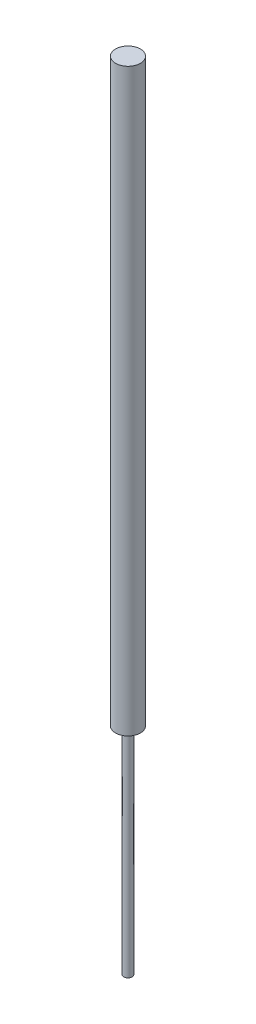
ISO-10303-21;
HEADER;
FILE_DESCRIPTION(('STEP AP214'),'2;1');
FILE_NAME('part.step','',(''),(''),'','','');
FILE_SCHEMA(('AUTOMOTIVE_DESIGN { 1 0 10303 214 1 1 1 1 }'));
ENDSEC;
DATA;
#1=APPLICATION_CONTEXT('core data for automotive mechanical design processes');
#2=APPLICATION_PROTOCOL_DEFINITION('international standard','automotive_design',2000,#1);
#3=PRODUCT_CONTEXT('',#1,'mechanical');
#4=PRODUCT('Part','Part','',(#3));
#5=PRODUCT_RELATED_PRODUCT_CATEGORY('part','',(#4));
#6=PRODUCT_DEFINITION_FORMATION('','',#4);
#7=PRODUCT_DEFINITION_CONTEXT('part definition',#1,'design');
#8=PRODUCT_DEFINITION('design','',#6,#7);
#9=PRODUCT_DEFINITION_SHAPE('','',#8);
#10=(LENGTH_UNIT() NAMED_UNIT(*) SI_UNIT(.MILLI.,.METRE.));
#11=(NAMED_UNIT(*) PLANE_ANGLE_UNIT() SI_UNIT($,.RADIAN.));
#12=(NAMED_UNIT(*) SI_UNIT($,.STERADIAN.) SOLID_ANGLE_UNIT());
#13=UNCERTAINTY_MEASURE_WITH_UNIT(LENGTH_MEASURE(1.E-05),#10,'distance_accuracy_value','');
#14=(GEOMETRIC_REPRESENTATION_CONTEXT(3) GLOBAL_UNCERTAINTY_ASSIGNED_CONTEXT((#13)) GLOBAL_UNIT_ASSIGNED_CONTEXT((#10,
#11,#12)) REPRESENTATION_CONTEXT('',''));
#15=CARTESIAN_POINT('',(0.,0.,0.));
#16=DIRECTION('',(0.,0.,1.));
#17=DIRECTION('',(1.,0.,0.));
#18=AXIS2_PLACEMENT_3D('',#15,#16,#17);
#19=CARTESIAN_POINT('',(0.,0.,0.));
#20=DIRECTION('',(0.,1.,0.));
#21=DIRECTION('',(0.,0.,1.));
#22=AXIS2_PLACEMENT_3D('',#19,#20,#21);
#23=PLANE('',#22);
#24=CARTESIAN_POINT('',(0.,0.,0.));
#25=DIRECTION('',(0.,1.,0.));
#26=DIRECTION('',(0.,0.,1.));
#27=AXIS2_PLACEMENT_3D('',#24,#25,#26);
#28=CIRCLE('',#27,1.5875);
#29=CARTESIAN_POINT('',(0.,0.,1.5875));
#30=VERTEX_POINT('',#29);
#31=EDGE_CURVE('E10',#30,#30,#28,.T.);
#32=ORIENTED_EDGE('',*,*,#31,.F.);
#33=EDGE_LOOP('',(#32));
#34=FACE_BOUND('',#33,.T.);
#35=ADVANCED_FACE('F31',(#34),#23,.F.);
#36=CARTESIAN_POINT('',(0.,304.8,0.));
#37=DIRECTION('',(0.,1.,0.));
#38=DIRECTION('',(0.,0.,1.));
#39=AXIS2_PLACEMENT_3D('',#36,#37,#38);
#40=CYLINDRICAL_SURFACE('',#39,1.5875);
#41=CARTESIAN_POINT('',(0.,82.55,0.));
#42=DIRECTION('',(0.,1.,0.));
#43=DIRECTION('',(0.,0.,1.));
#44=AXIS2_PLACEMENT_3D('',#41,#42,#43);
#45=CIRCLE('',#44,1.5875);
#46=CARTESIAN_POINT('',(0.,82.55,1.5875));
#47=VERTEX_POINT('',#46);
#48=EDGE_CURVE('E37',#47,#47,#45,.T.);
#49=ORIENTED_EDGE('',*,*,#48,.F.);
#50=EDGE_LOOP('',(#49));
#51=FACE_BOUND('',#50,.T.);
#52=ORIENTED_EDGE('',*,*,#31,.T.);
#53=EDGE_LOOP('',(#52));
#54=FACE_BOUND('',#53,.T.);
#55=ADVANCED_FACE('F61',(#51,#54),#40,.T.);
#56=CARTESIAN_POINT('',(1.5875,82.55,0.));
#57=DIRECTION('',(0.,1.,0.));
#58=DIRECTION('',(0.,0.,1.));
#59=AXIS2_PLACEMENT_3D('',#56,#57,#58);
#60=PLANE('',#59);
#61=CARTESIAN_POINT('',(0.,82.55,0.));
#62=DIRECTION('',(0.,1.,0.));
#63=DIRECTION('',(0.,0.,1.));
#64=AXIS2_PLACEMENT_3D('',#61,#62,#63);
#65=CIRCLE('',#64,4.76250000000003);
#66=CARTESIAN_POINT('',(0.,82.55,4.76250000000003));
#67=VERTEX_POINT('',#66);
#68=EDGE_CURVE('E41',#67,#67,#65,.T.);
#69=ORIENTED_EDGE('',*,*,#68,.F.);
#70=EDGE_LOOP('',(#69));
#71=FACE_BOUND('',#70,.T.);
#72=ORIENTED_EDGE('',*,*,#48,.T.);
#73=EDGE_LOOP('',(#72));
#74=FACE_BOUND('',#73,.T.);
#75=ADVANCED_FACE('F56',(#71,#74),#60,.F.);
#76=CARTESIAN_POINT('',(0.,304.8,0.));
#77=DIRECTION('',(0.,1.,0.));
#78=DIRECTION('',(0.,0.,1.));
#79=AXIS2_PLACEMENT_3D('',#76,#77,#78);
#80=CYLINDRICAL_SURFACE('',#79,4.76250000000003);
#81=CARTESIAN_POINT('',(0.,304.8,0.));
#82=DIRECTION('',(0.,1.,0.));
#83=DIRECTION('',(0.,0.,1.));
#84=AXIS2_PLACEMENT_3D('',#81,#82,#83);
#85=CIRCLE('',#84,4.76250000000003);
#86=CARTESIAN_POINT('',(0.,304.8,4.76250000000003));
#87=VERTEX_POINT('',#86);
#88=EDGE_CURVE('E45',#87,#87,#85,.T.);
#89=ORIENTED_EDGE('',*,*,#88,.F.);
#90=EDGE_LOOP('',(#89));
#91=FACE_BOUND('',#90,.T.);
#92=ORIENTED_EDGE('',*,*,#68,.T.);
#93=EDGE_LOOP('',(#92));
#94=FACE_BOUND('',#93,.T.);
#95=ADVANCED_FACE('F53',(#91,#94),#80,.T.);
#96=CARTESIAN_POINT('',(4.76250000000003,304.8,0.));
#97=DIRECTION('',(0.,-1.,0.));
#98=DIRECTION('',(0.,0.,-1.));
#99=AXIS2_PLACEMENT_3D('',#96,#97,#98);
#100=PLANE('',#99);
#101=ORIENTED_EDGE('',*,*,#88,.T.);
#102=EDGE_LOOP('',(#101));
#103=FACE_BOUND('',#102,.T.);
#104=ADVANCED_FACE('F51',(#103),#100,.F.);
#105=CLOSED_SHELL('',(#35,#55,#75,#95,#104));
#106=MANIFOLD_SOLID_BREP('B2',#105);
#107=ADVANCED_BREP_SHAPE_REPRESENTATION('',(#18,#106),#14);
#108=SHAPE_DEFINITION_REPRESENTATION(#9,#107);
ENDSEC;
END-ISO-10303-21;
